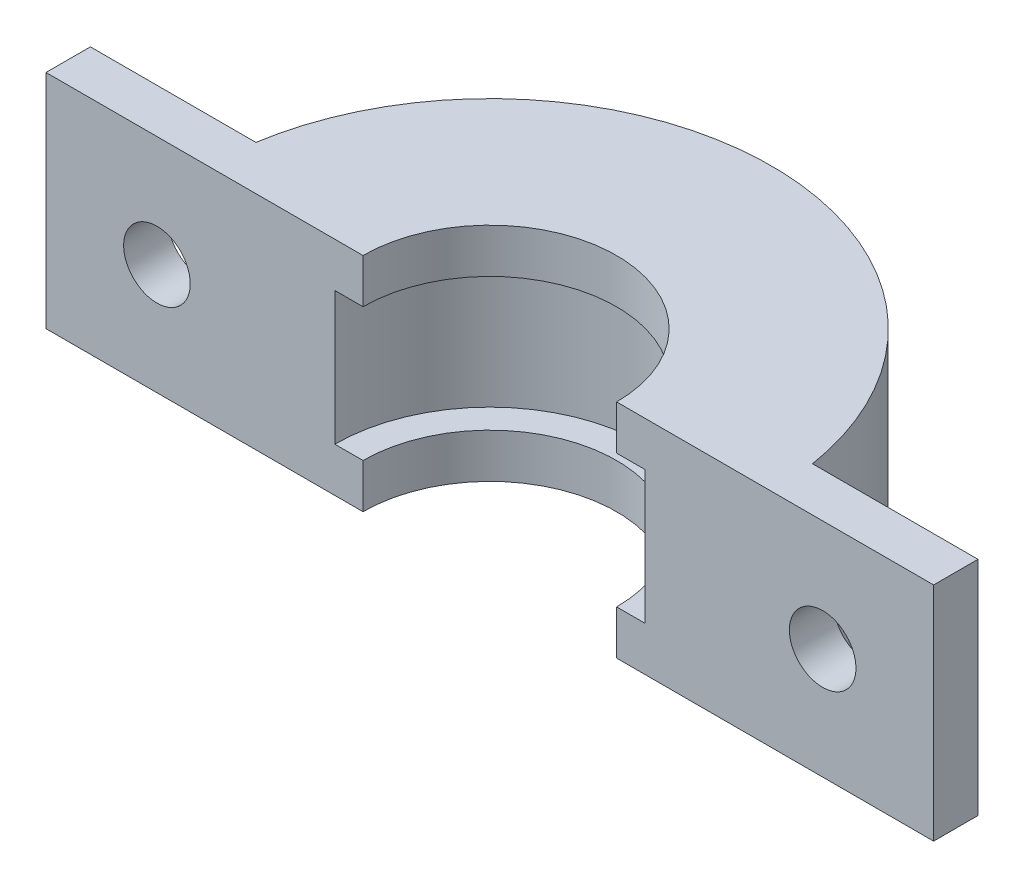
ISO-10303-21;
HEADER;
FILE_DESCRIPTION(('STEP AP214'),'2;1');
FILE_NAME('part.step','',(''),(''),'','','');
FILE_SCHEMA(('AUTOMOTIVE_DESIGN { 1 0 10303 214 1 1 1 1 }'));
ENDSEC;
DATA;
#1=APPLICATION_CONTEXT('core data for automotive mechanical design processes');
#2=APPLICATION_PROTOCOL_DEFINITION('international standard','automotive_design',2000,#1);
#3=PRODUCT_CONTEXT('',#1,'mechanical');
#4=PRODUCT('Part','Part','',(#3));
#5=PRODUCT_RELATED_PRODUCT_CATEGORY('part','',(#4));
#6=PRODUCT_DEFINITION_FORMATION('','',#4);
#7=PRODUCT_DEFINITION_CONTEXT('part definition',#1,'design');
#8=PRODUCT_DEFINITION('design','',#6,#7);
#9=PRODUCT_DEFINITION_SHAPE('','',#8);
#10=(LENGTH_UNIT() NAMED_UNIT(*) SI_UNIT(.MILLI.,.METRE.));
#11=(NAMED_UNIT(*) PLANE_ANGLE_UNIT() SI_UNIT($,.RADIAN.));
#12=(NAMED_UNIT(*) SI_UNIT($,.STERADIAN.) SOLID_ANGLE_UNIT());
#13=UNCERTAINTY_MEASURE_WITH_UNIT(LENGTH_MEASURE(1.E-05),#10,'distance_accuracy_value','');
#14=(GEOMETRIC_REPRESENTATION_CONTEXT(3) GLOBAL_UNCERTAINTY_ASSIGNED_CONTEXT((#13)) GLOBAL_UNIT_ASSIGNED_CONTEXT((#10,
#11,#12)) REPRESENTATION_CONTEXT('',''));
#15=CARTESIAN_POINT('',(0.,0.,0.));
#16=DIRECTION('',(0.,0.,1.));
#17=DIRECTION('',(1.,0.,0.));
#18=AXIS2_PLACEMENT_3D('',#15,#16,#17);
#19=CARTESIAN_POINT('',(0.,5.,0.));
#20=DIRECTION('',(0.,-1.,0.));
#21=DIRECTION('',(0.,0.,-1.));
#22=AXIS2_PLACEMENT_3D('',#19,#20,#21);
#23=CYLINDRICAL_SURFACE('',#22,12.7);
#24=CARTESIAN_POINT('',(0.,5.,0.));
#25=DIRECTION('',(0.,1.,0.));
#26=DIRECTION('',(0.,0.,1.));
#27=AXIS2_PLACEMENT_3D('',#24,#25,#26);
#28=CIRCLE('',#27,12.7);
#29=CARTESIAN_POINT('',(12.5415310070182,5.,-2.));
#30=VERTEX_POINT('',#29);
#31=CARTESIAN_POINT('',(-12.5415310070182,5.,-2.));
#32=VERTEX_POINT('',#31);
#33=EDGE_CURVE('E57',#30,#32,#28,.T.);
#34=ORIENTED_EDGE('',*,*,#33,.F.);
#35=DIRECTION('',(0.,-1.,0.));
#36=VECTOR('',#35,1.);
#37=CARTESIAN_POINT('',(12.5415310070182,5.,-2.));
#38=LINE('',#37,#36);
#39=CARTESIAN_POINT('',(12.5415310070182,-5.,-2.));
#40=VERTEX_POINT('',#39);
#41=EDGE_CURVE('E61',#30,#40,#38,.T.);
#42=ORIENTED_EDGE('',*,*,#41,.T.);
#43=CARTESIAN_POINT('',(0.,-5.,0.));
#44=DIRECTION('',(0.,1.,0.));
#45=DIRECTION('',(0.,0.,1.));
#46=AXIS2_PLACEMENT_3D('',#43,#44,#45);
#47=CIRCLE('',#46,12.7);
#48=CARTESIAN_POINT('',(-12.5415310070182,-5.,-2.));
#49=VERTEX_POINT('',#48);
#50=EDGE_CURVE('E135',#40,#49,#47,.T.);
#51=ORIENTED_EDGE('',*,*,#50,.T.);
#52=DIRECTION('',(0.,-1.,0.));
#53=VECTOR('',#52,1.);
#54=CARTESIAN_POINT('',(-12.5415310070182,5.,-2.));
#55=LINE('',#54,#53);
#56=EDGE_CURVE('E194',#32,#49,#55,.T.);
#57=ORIENTED_EDGE('',*,*,#56,.F.);
#58=EDGE_LOOP('',(#34,#42,#51,#57));
#59=FACE_BOUND('',#58,.T.);
#60=ADVANCED_FACE('F41',(#59),#23,.T.);
#61=CARTESIAN_POINT('',(0.,5.,0.));
#62=DIRECTION('',(0.,-1.,0.));
#63=DIRECTION('',(0.,0.,-1.));
#64=AXIS2_PLACEMENT_3D('',#61,#62,#63);
#65=CYLINDRICAL_SURFACE('',#64,5.715);
#66=DIRECTION('',(0.,-1.,0.));
#67=VECTOR('',#66,1.);
#68=CARTESIAN_POINT('',(5.715,5.,0.));
#69=LINE('',#68,#67);
#70=CARTESIAN_POINT('',(5.715,-3.,0.));
#71=VERTEX_POINT('',#70);
#72=CARTESIAN_POINT('',(5.715,-5.,0.));
#73=VERTEX_POINT('',#72);
#74=EDGE_CURVE('E50',#71,#73,#69,.T.);
#75=ORIENTED_EDGE('',*,*,#74,.F.);
#76=CARTESIAN_POINT('',(0.,-3.,0.));
#77=DIRECTION('',(0.,1.,0.));
#78=DIRECTION('',(0.,0.,1.));
#79=AXIS2_PLACEMENT_3D('',#76,#77,#78);
#80=CIRCLE('',#79,5.715);
#81=CARTESIAN_POINT('',(-5.715,-3.,0.));
#82=VERTEX_POINT('',#81);
#83=EDGE_CURVE('E228',#71,#82,#80,.T.);
#84=ORIENTED_EDGE('',*,*,#83,.T.);
#85=DIRECTION('',(0.,-1.,0.));
#86=VECTOR('',#85,1.);
#87=CARTESIAN_POINT('',(-5.715,5.,0.));
#88=LINE('',#87,#86);
#89=CARTESIAN_POINT('',(-5.715,-5.,0.));
#90=VERTEX_POINT('',#89);
#91=EDGE_CURVE('E254',#82,#90,#88,.T.);
#92=ORIENTED_EDGE('',*,*,#91,.T.);
#93=CARTESIAN_POINT('',(0.,-5.,0.));
#94=DIRECTION('',(0.,1.,0.));
#95=DIRECTION('',(0.,0.,1.));
#96=AXIS2_PLACEMENT_3D('',#93,#94,#95);
#97=CIRCLE('',#96,5.715);
#98=EDGE_CURVE('E232',#73,#90,#97,.T.);
#99=ORIENTED_EDGE('',*,*,#98,.F.);
#100=EDGE_LOOP('',(#75,#84,#92,#99));
#101=FACE_BOUND('',#100,.T.);
#102=ADVANCED_FACE('F282',(#101),#65,.F.);
#103=CARTESIAN_POINT('',(0.,5.,0.));
#104=DIRECTION('',(0.,0.,1.));
#105=DIRECTION('',(1.,0.,0.));
#106=AXIS2_PLACEMENT_3D('',#103,#104,#105);
#107=PLANE('',#106);
#108=ORIENTED_EDGE('',*,*,#74,.T.);
#109=DIRECTION('',(-1.,0.,0.));
#110=VECTOR('',#109,1.);
#111=CARTESIAN_POINT('',(0.,-5.,0.));
#112=LINE('',#111,#110);
#113=CARTESIAN_POINT('',(20.,-4.99999999999986,0.));
#114=VERTEX_POINT('',#113);
#115=EDGE_CURVE('E247',#114,#73,#112,.T.);
#116=ORIENTED_EDGE('',*,*,#115,.F.);
#117=DIRECTION('',(0.,1.,0.));
#118=VECTOR('',#117,1.);
#119=CARTESIAN_POINT('',(20.,-4.99999999999986,0.));
#120=LINE('',#119,#118);
#121=CARTESIAN_POINT('',(20.,5.00000000000014,0.));
#122=VERTEX_POINT('',#121);
#123=EDGE_CURVE('E140',#114,#122,#120,.T.);
#124=ORIENTED_EDGE('',*,*,#123,.T.);
#125=DIRECTION('',(-1.,0.,0.));
#126=VECTOR('',#125,1.);
#127=CARTESIAN_POINT('',(0.,5.,0.));
#128=LINE('',#127,#126);
#129=CARTESIAN_POINT('',(5.715,5.,0.));
#130=VERTEX_POINT('',#129);
#131=EDGE_CURVE('E237',#122,#130,#128,.T.);
#132=ORIENTED_EDGE('',*,*,#131,.T.);
#133=CARTESIAN_POINT('',(5.715,3.,0.));
#134=VERTEX_POINT('',#133);
#135=EDGE_CURVE('E11',#130,#134,#69,.T.);
#136=ORIENTED_EDGE('',*,*,#135,.T.);
#137=DIRECTION('',(1.,0.,0.));
#138=VECTOR('',#137,1.);
#139=CARTESIAN_POINT('',(0.,3.,0.));
#140=LINE('',#139,#138);
#141=CARTESIAN_POINT('',(6.985,3.,0.));
#142=VERTEX_POINT('',#141);
#143=EDGE_CURVE('E201',#134,#142,#140,.T.);
#144=ORIENTED_EDGE('',*,*,#143,.T.);
#145=DIRECTION('',(0.,1.,0.));
#146=VECTOR('',#145,1.);
#147=CARTESIAN_POINT('',(6.985,-3.,0.));
#148=LINE('',#147,#146);
#149=CARTESIAN_POINT('',(6.985,-3.,0.));
#150=VERTEX_POINT('',#149);
#151=EDGE_CURVE('E210',#150,#142,#148,.T.);
#152=ORIENTED_EDGE('',*,*,#151,.F.);
#153=DIRECTION('',(1.,0.,0.));
#154=VECTOR('',#153,1.);
#155=CARTESIAN_POINT('',(0.,-3.,0.));
#156=LINE('',#155,#154);
#157=EDGE_CURVE('E206',#71,#150,#156,.T.);
#158=ORIENTED_EDGE('',*,*,#157,.F.);
#159=EDGE_LOOP('',(#108,#116,#124,#132,#136,#144,#152,#158));
#160=FACE_BOUND('',#159,.T.);
#161=CARTESIAN_POINT('',(15.,1.02348685082632E-13,0.));
#162=DIRECTION('',(0.,0.,1.));
#163=DIRECTION('',(-1.,0.,0.));
#164=AXIS2_PLACEMENT_3D('',#161,#162,#163);
#165=CIRCLE('',#164,1.5);
#166=CARTESIAN_POINT('',(13.5,1.02348685082632E-13,0.));
#167=VERTEX_POINT('',#166);
#168=EDGE_CURVE('E331',#167,#167,#165,.T.);
#169=ORIENTED_EDGE('',*,*,#168,.F.);
#170=EDGE_LOOP('',(#169));
#171=FACE_BOUND('',#170,.T.);
#172=ADVANCED_FACE('F286',(#160,#171),#107,.T.);
#173=CARTESIAN_POINT('',(-5.715,5.,0.));
#174=VERTEX_POINT('',#173);
#175=CARTESIAN_POINT('',(-20.,5.,0.));
#176=VERTEX_POINT('',#175);
#177=EDGE_CURVE('E241',#174,#176,#128,.T.);
#178=ORIENTED_EDGE('',*,*,#177,.T.);
#179=DIRECTION('',(0.,-1.,0.));
#180=VECTOR('',#179,1.);
#181=CARTESIAN_POINT('',(-20.,-5.,0.));
#182=LINE('',#181,#180);
#183=CARTESIAN_POINT('',(-20.,-5.,0.));
#184=VERTEX_POINT('',#183);
#185=EDGE_CURVE('E172',#176,#184,#182,.T.);
#186=ORIENTED_EDGE('',*,*,#185,.T.);
#187=EDGE_CURVE('E238',#90,#184,#112,.T.);
#188=ORIENTED_EDGE('',*,*,#187,.F.);
#189=ORIENTED_EDGE('',*,*,#91,.F.);
#190=CARTESIAN_POINT('',(-6.985,-3.,0.));
#191=VERTEX_POINT('',#190);
#192=EDGE_CURVE('E202',#191,#82,#156,.T.);
#193=ORIENTED_EDGE('',*,*,#192,.F.);
#194=DIRECTION('',(0.,1.,0.));
#195=VECTOR('',#194,1.);
#196=CARTESIAN_POINT('',(-6.985,-3.,0.));
#197=LINE('',#196,#195);
#198=CARTESIAN_POINT('',(-6.985,3.,0.));
#199=VERTEX_POINT('',#198);
#200=EDGE_CURVE('E219',#191,#199,#197,.T.);
#201=ORIENTED_EDGE('',*,*,#200,.T.);
#202=CARTESIAN_POINT('',(-5.715,3.,0.));
#203=VERTEX_POINT('',#202);
#204=EDGE_CURVE('E211',#199,#203,#140,.T.);
#205=ORIENTED_EDGE('',*,*,#204,.T.);
#206=EDGE_CURVE('E251',#174,#203,#88,.T.);
#207=ORIENTED_EDGE('',*,*,#206,.F.);
#208=EDGE_LOOP('',(#178,#186,#188,#189,#193,#201,#205,#207));
#209=FACE_BOUND('',#208,.T.);
#210=CARTESIAN_POINT('',(-15.,0.,0.));
#211=DIRECTION('',(0.,0.,1.));
#212=DIRECTION('',(1.,0.,0.));
#213=AXIS2_PLACEMENT_3D('',#210,#211,#212);
#214=CIRCLE('',#213,1.5);
#215=CARTESIAN_POINT('',(-13.5,0.,0.));
#216=VERTEX_POINT('',#215);
#217=EDGE_CURVE('E167',#216,#216,#214,.T.);
#218=ORIENTED_EDGE('',*,*,#217,.F.);
#219=EDGE_LOOP('',(#218));
#220=FACE_BOUND('',#219,.T.);
#221=ADVANCED_FACE('F266',(#209,#220),#107,.T.);
#222=CARTESIAN_POINT('',(0.,3.,0.));
#223=DIRECTION('',(0.,1.,0.));
#224=DIRECTION('',(0.,0.,1.));
#225=AXIS2_PLACEMENT_3D('',#222,#223,#224);
#226=CIRCLE('',#225,5.715);
#227=EDGE_CURVE('E223',#134,#203,#226,.T.);
#228=ORIENTED_EDGE('',*,*,#227,.F.);
#229=ORIENTED_EDGE('',*,*,#135,.F.);
#230=CARTESIAN_POINT('',(0.,5.,0.));
#231=DIRECTION('',(0.,1.,0.));
#232=DIRECTION('',(0.,0.,1.));
#233=AXIS2_PLACEMENT_3D('',#230,#231,#232);
#234=CIRCLE('',#233,5.715);
#235=EDGE_CURVE('E233',#130,#174,#234,.T.);
#236=ORIENTED_EDGE('',*,*,#235,.T.);
#237=ORIENTED_EDGE('',*,*,#206,.T.);
#238=EDGE_LOOP('',(#228,#229,#236,#237));
#239=FACE_BOUND('',#238,.T.);
#240=ADVANCED_FACE('F43',(#239),#65,.F.);
#241=CARTESIAN_POINT('',(0.,5.,0.));
#242=DIRECTION('',(0.,1.,0.));
#243=DIRECTION('',(0.,0.,1.));
#244=AXIS2_PLACEMENT_3D('',#241,#242,#243);
#245=PLANE('',#244);
#246=ORIENTED_EDGE('',*,*,#235,.F.);
#247=ORIENTED_EDGE('',*,*,#131,.F.);
#248=DIRECTION('',(0.,0.,1.));
#249=VECTOR('',#248,1.);
#250=CARTESIAN_POINT('',(20.,5.00000000000014,-2.));
#251=LINE('',#250,#249);
#252=CARTESIAN_POINT('',(20.,5.00000000000014,-2.));
#253=VERTEX_POINT('',#252);
#254=EDGE_CURVE('E149',#253,#122,#251,.T.);
#255=ORIENTED_EDGE('',*,*,#254,.F.);
#256=DIRECTION('',(-1.,0.,0.));
#257=VECTOR('',#256,1.);
#258=CARTESIAN_POINT('',(11.,5.00000000000008,-2.));
#259=LINE('',#258,#257);
#260=EDGE_CURVE('E150',#253,#30,#259,.T.);
#261=ORIENTED_EDGE('',*,*,#260,.T.);
#262=ORIENTED_EDGE('',*,*,#33,.T.);
#263=DIRECTION('',(-1.,0.,0.));
#264=VECTOR('',#263,1.);
#265=CARTESIAN_POINT('',(-11.,5.,-2.));
#266=LINE('',#265,#264);
#267=CARTESIAN_POINT('',(-20.,5.,-2.));
#268=VERTEX_POINT('',#267);
#269=EDGE_CURVE('E183',#32,#268,#266,.T.);
#270=ORIENTED_EDGE('',*,*,#269,.T.);
#271=DIRECTION('',(0.,0.,1.));
#272=VECTOR('',#271,1.);
#273=CARTESIAN_POINT('',(-20.,5.,-2.));
#274=LINE('',#273,#272);
#275=EDGE_CURVE('E190',#268,#176,#274,.T.);
#276=ORIENTED_EDGE('',*,*,#275,.T.);
#277=ORIENTED_EDGE('',*,*,#177,.F.);
#278=EDGE_LOOP('',(#246,#247,#255,#261,#262,#270,#276,#277));
#279=FACE_BOUND('',#278,.T.);
#280=ADVANCED_FACE('F273',(#279),#245,.T.);
#281=CARTESIAN_POINT('',(0.,-5.,0.));
#282=DIRECTION('',(0.,1.,0.));
#283=DIRECTION('',(0.,0.,1.));
#284=AXIS2_PLACEMENT_3D('',#281,#282,#283);
#285=PLANE('',#284);
#286=ORIENTED_EDGE('',*,*,#115,.T.);
#287=ORIENTED_EDGE('',*,*,#98,.T.);
#288=ORIENTED_EDGE('',*,*,#187,.T.);
#289=DIRECTION('',(0.,0.,1.));
#290=VECTOR('',#289,1.);
#291=CARTESIAN_POINT('',(-20.,-5.,-2.));
#292=LINE('',#291,#290);
#293=CARTESIAN_POINT('',(-20.,-5.,-2.));
#294=VERTEX_POINT('',#293);
#295=EDGE_CURVE('E186',#294,#184,#292,.T.);
#296=ORIENTED_EDGE('',*,*,#295,.F.);
#297=DIRECTION('',(1.,0.,0.));
#298=VECTOR('',#297,1.);
#299=CARTESIAN_POINT('',(-11.,-5.,-2.));
#300=LINE('',#299,#298);
#301=EDGE_CURVE('E180',#294,#49,#300,.T.);
#302=ORIENTED_EDGE('',*,*,#301,.T.);
#303=ORIENTED_EDGE('',*,*,#50,.F.);
#304=DIRECTION('',(1.,0.,0.));
#305=VECTOR('',#304,1.);
#306=CARTESIAN_POINT('',(11.,-4.99999999999992,-2.));
#307=LINE('',#306,#305);
#308=CARTESIAN_POINT('',(20.,-4.99999999999986,-2.));
#309=VERTEX_POINT('',#308);
#310=EDGE_CURVE('E129',#40,#309,#307,.T.);
#311=ORIENTED_EDGE('',*,*,#310,.T.);
#312=DIRECTION('',(0.,0.,1.));
#313=VECTOR('',#312,1.);
#314=CARTESIAN_POINT('',(20.,-4.99999999999986,-2.));
#315=LINE('',#314,#313);
#316=EDGE_CURVE('E132',#309,#114,#315,.T.);
#317=ORIENTED_EDGE('',*,*,#316,.T.);
#318=EDGE_LOOP('',(#286,#287,#288,#296,#302,#303,#311,#317));
#319=FACE_BOUND('',#318,.T.);
#320=ADVANCED_FACE('F131',(#319),#285,.F.);
#321=CARTESIAN_POINT('',(0.,-3.,0.));
#322=DIRECTION('',(0.,1.,0.));
#323=DIRECTION('',(0.,0.,1.));
#324=AXIS2_PLACEMENT_3D('',#321,#322,#323);
#325=CYLINDRICAL_SURFACE('',#324,6.985);
#326=CARTESIAN_POINT('',(0.,3.,0.));
#327=DIRECTION('',(0.,1.,0.));
#328=DIRECTION('',(0.,0.,1.));
#329=AXIS2_PLACEMENT_3D('',#326,#327,#328);
#330=CIRCLE('',#329,6.985);
#331=EDGE_CURVE('E215',#142,#199,#330,.T.);
#332=ORIENTED_EDGE('',*,*,#331,.T.);
#333=ORIENTED_EDGE('',*,*,#200,.F.);
#334=CARTESIAN_POINT('',(0.,-3.,0.));
#335=DIRECTION('',(0.,1.,0.));
#336=DIRECTION('',(0.,0.,1.));
#337=AXIS2_PLACEMENT_3D('',#334,#335,#336);
#338=CIRCLE('',#337,6.985);
#339=EDGE_CURVE('E205',#150,#191,#338,.T.);
#340=ORIENTED_EDGE('',*,*,#339,.F.);
#341=ORIENTED_EDGE('',*,*,#151,.T.);
#342=EDGE_LOOP('',(#332,#333,#340,#341));
#343=FACE_BOUND('',#342,.T.);
#344=ADVANCED_FACE('F293',(#343),#325,.F.);
#345=CARTESIAN_POINT('',(0.,-3.,0.));
#346=DIRECTION('',(0.,1.,0.));
#347=DIRECTION('',(0.,0.,1.));
#348=AXIS2_PLACEMENT_3D('',#345,#346,#347);
#349=PLANE('',#348);
#350=ORIENTED_EDGE('',*,*,#157,.T.);
#351=ORIENTED_EDGE('',*,*,#339,.T.);
#352=ORIENTED_EDGE('',*,*,#192,.T.);
#353=ORIENTED_EDGE('',*,*,#83,.F.);
#354=EDGE_LOOP('',(#350,#351,#352,#353));
#355=FACE_BOUND('',#354,.T.);
#356=ADVANCED_FACE('F298',(#355),#349,.T.);
#357=CARTESIAN_POINT('',(0.,3.,0.));
#358=DIRECTION('',(0.,1.,0.));
#359=DIRECTION('',(0.,0.,1.));
#360=AXIS2_PLACEMENT_3D('',#357,#358,#359);
#361=PLANE('',#360);
#362=ORIENTED_EDGE('',*,*,#227,.T.);
#363=ORIENTED_EDGE('',*,*,#204,.F.);
#364=ORIENTED_EDGE('',*,*,#331,.F.);
#365=ORIENTED_EDGE('',*,*,#143,.F.);
#366=EDGE_LOOP('',(#362,#363,#364,#365));
#367=FACE_BOUND('',#366,.T.);
#368=ADVANCED_FACE('F300',(#367),#361,.F.);
#369=CARTESIAN_POINT('',(0.,0.,-2.));
#370=DIRECTION('',(0.,0.,1.));
#371=DIRECTION('',(1.,0.,0.));
#372=AXIS2_PLACEMENT_3D('',#369,#370,#371);
#373=PLANE('',#372);
#374=CARTESIAN_POINT('',(-15.,0.,-2.));
#375=DIRECTION('',(0.,0.,1.));
#376=DIRECTION('',(1.,0.,0.));
#377=AXIS2_PLACEMENT_3D('',#374,#375,#376);
#378=CIRCLE('',#377,1.5);
#379=CARTESIAN_POINT('',(-13.5,0.,-2.));
#380=VERTEX_POINT('',#379);
#381=EDGE_CURVE('E168',#380,#380,#378,.T.);
#382=ORIENTED_EDGE('',*,*,#381,.T.);
#383=EDGE_LOOP('',(#382));
#384=FACE_BOUND('',#383,.T.);
#385=ORIENTED_EDGE('',*,*,#269,.F.);
#386=ORIENTED_EDGE('',*,*,#56,.T.);
#387=ORIENTED_EDGE('',*,*,#301,.F.);
#388=DIRECTION('',(0.,-1.,0.));
#389=VECTOR('',#388,1.);
#390=CARTESIAN_POINT('',(-20.,-5.,-2.));
#391=LINE('',#390,#389);
#392=EDGE_CURVE('E176',#268,#294,#391,.T.);
#393=ORIENTED_EDGE('',*,*,#392,.F.);
#394=EDGE_LOOP('',(#385,#386,#387,#393));
#395=FACE_BOUND('',#394,.T.);
#396=ADVANCED_FACE('F280',(#384,#395),#373,.F.);
#397=CARTESIAN_POINT('',(-20.,-5.,-2.));
#398=DIRECTION('',(-1.,0.,0.));
#399=DIRECTION('',(0.,0.,1.));
#400=AXIS2_PLACEMENT_3D('',#397,#398,#399);
#401=PLANE('',#400);
#402=ORIENTED_EDGE('',*,*,#185,.F.);
#403=ORIENTED_EDGE('',*,*,#275,.F.);
#404=ORIENTED_EDGE('',*,*,#392,.T.);
#405=ORIENTED_EDGE('',*,*,#295,.T.);
#406=EDGE_LOOP('',(#402,#403,#404,#405));
#407=FACE_BOUND('',#406,.T.);
#408=ADVANCED_FACE('F277',(#407),#401,.T.);
#409=CARTESIAN_POINT('',(-15.,0.,-2.));
#410=DIRECTION('',(0.,0.,1.));
#411=DIRECTION('',(1.,0.,0.));
#412=AXIS2_PLACEMENT_3D('',#409,#410,#411);
#413=CYLINDRICAL_SURFACE('',#412,1.5);
#414=ORIENTED_EDGE('',*,*,#381,.F.);
#415=EDGE_LOOP('',(#414));
#416=FACE_BOUND('',#415,.T.);
#417=ORIENTED_EDGE('',*,*,#217,.T.);
#418=EDGE_LOOP('',(#417));
#419=FACE_BOUND('',#418,.T.);
#420=ADVANCED_FACE('F309',(#416,#419),#413,.F.);
#421=CARTESIAN_POINT('',(0.,0.,-2.));
#422=DIRECTION('',(0.,0.,-1.));
#423=DIRECTION('',(-1.,0.,0.));
#424=AXIS2_PLACEMENT_3D('',#421,#422,#423);
#425=PLANE('',#424);
#426=CARTESIAN_POINT('',(15.,1.02348685082632E-13,-2.));
#427=DIRECTION('',(0.,0.,1.));
#428=DIRECTION('',(-1.,0.,0.));
#429=AXIS2_PLACEMENT_3D('',#426,#427,#428);
#430=CIRCLE('',#429,1.5);
#431=CARTESIAN_POINT('',(13.5,1.02348685082632E-13,-2.));
#432=VERTEX_POINT('',#431);
#433=EDGE_CURVE('E162',#432,#432,#430,.T.);
#434=ORIENTED_EDGE('',*,*,#433,.T.);
#435=EDGE_LOOP('',(#434));
#436=FACE_BOUND('',#435,.T.);
#437=ORIENTED_EDGE('',*,*,#41,.F.);
#438=ORIENTED_EDGE('',*,*,#260,.F.);
#439=DIRECTION('',(0.,1.,0.));
#440=VECTOR('',#439,1.);
#441=CARTESIAN_POINT('',(20.,-4.99999999999986,-2.));
#442=LINE('',#441,#440);
#443=EDGE_CURVE('E139',#309,#253,#442,.T.);
#444=ORIENTED_EDGE('',*,*,#443,.F.);
#445=ORIENTED_EDGE('',*,*,#310,.F.);
#446=EDGE_LOOP('',(#437,#438,#444,#445));
#447=FACE_BOUND('',#446,.T.);
#448=ADVANCED_FACE('F152',(#436,#447),#425,.T.);
#449=CARTESIAN_POINT('',(20.,-4.99999999999986,-2.));
#450=DIRECTION('',(1.,0.,0.));
#451=DIRECTION('',(0.,1.,0.));
#452=AXIS2_PLACEMENT_3D('',#449,#450,#451);
#453=PLANE('',#452);
#454=ORIENTED_EDGE('',*,*,#123,.F.);
#455=ORIENTED_EDGE('',*,*,#316,.F.);
#456=ORIENTED_EDGE('',*,*,#443,.T.);
#457=ORIENTED_EDGE('',*,*,#254,.T.);
#458=EDGE_LOOP('',(#454,#455,#456,#457));
#459=FACE_BOUND('',#458,.T.);
#460=ADVANCED_FACE('F144',(#459),#453,.T.);
#461=CARTESIAN_POINT('',(15.,1.02348685082632E-13,-2.));
#462=DIRECTION('',(0.,0.,1.));
#463=DIRECTION('',(1.,0.,0.));
#464=AXIS2_PLACEMENT_3D('',#461,#462,#463);
#465=CYLINDRICAL_SURFACE('',#464,1.5);
#466=ORIENTED_EDGE('',*,*,#433,.F.);
#467=EDGE_LOOP('',(#466));
#468=FACE_BOUND('',#467,.T.);
#469=ORIENTED_EDGE('',*,*,#168,.T.);
#470=EDGE_LOOP('',(#469));
#471=FACE_BOUND('',#470,.T.);
#472=ADVANCED_FACE('F318',(#468,#471),#465,.F.);
#473=CLOSED_SHELL('',(#60,#102,#172,#221,#240,#280,#320,#344,#356,#368,#396,#408,#420,#448,#460,#472));
#474=MANIFOLD_SOLID_BREP('B2',#473);
#475=ADVANCED_BREP_SHAPE_REPRESENTATION('',(#18,#474),#14);
#476=SHAPE_DEFINITION_REPRESENTATION(#9,#475);
ENDSEC;
END-ISO-10303-21;
